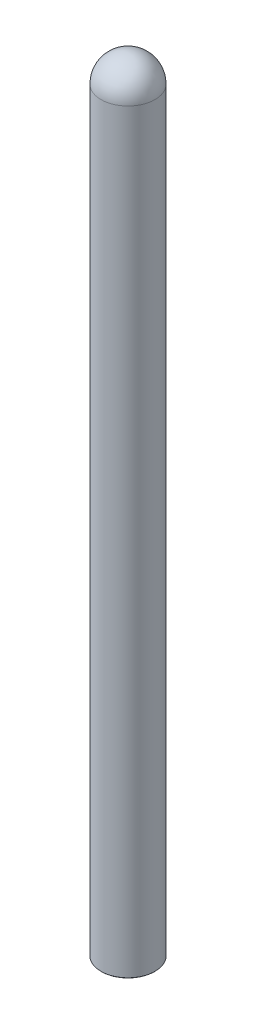
ISO-10303-21;
HEADER;
FILE_DESCRIPTION(('STEP AP214'),'2;1');
FILE_NAME('part.step','',(''),(''),'','','');
FILE_SCHEMA(('AUTOMOTIVE_DESIGN { 1 0 10303 214 1 1 1 1 }'));
ENDSEC;
DATA;
#1=APPLICATION_CONTEXT('core data for automotive mechanical design processes');
#2=APPLICATION_PROTOCOL_DEFINITION('international standard','automotive_design',2000,#1);
#3=PRODUCT_CONTEXT('',#1,'mechanical');
#4=PRODUCT('Part','Part','',(#3));
#5=PRODUCT_RELATED_PRODUCT_CATEGORY('part','',(#4));
#6=PRODUCT_DEFINITION_FORMATION('','',#4);
#7=PRODUCT_DEFINITION_CONTEXT('part definition',#1,'design');
#8=PRODUCT_DEFINITION('design','',#6,#7);
#9=PRODUCT_DEFINITION_SHAPE('','',#8);
#10=(LENGTH_UNIT() NAMED_UNIT(*) SI_UNIT(.MILLI.,.METRE.));
#11=(NAMED_UNIT(*) PLANE_ANGLE_UNIT() SI_UNIT($,.RADIAN.));
#12=(NAMED_UNIT(*) SI_UNIT($,.STERADIAN.) SOLID_ANGLE_UNIT());
#13=UNCERTAINTY_MEASURE_WITH_UNIT(LENGTH_MEASURE(1.E-05),#10,'distance_accuracy_value','');
#14=(GEOMETRIC_REPRESENTATION_CONTEXT(3) GLOBAL_UNCERTAINTY_ASSIGNED_CONTEXT((#13)) GLOBAL_UNIT_ASSIGNED_CONTEXT((#10,
#11,#12)) REPRESENTATION_CONTEXT('',''));
#15=CARTESIAN_POINT('',(0.,0.,0.));
#16=DIRECTION('',(0.,0.,1.));
#17=DIRECTION('',(1.,0.,0.));
#18=AXIS2_PLACEMENT_3D('',#15,#16,#17);
#19=CARTESIAN_POINT('',(0.,0.,0.));
#20=DIRECTION('',(0.,-1.,0.));
#21=DIRECTION('',(0.,0.,-1.));
#22=AXIS2_PLACEMENT_3D('',#19,#20,#21);
#23=PLANE('',#22);
#24=CARTESIAN_POINT('',(0.,0.,0.));
#25=DIRECTION('',(0.,-1.,0.));
#26=DIRECTION('',(0.,0.,-1.));
#27=AXIS2_PLACEMENT_3D('',#24,#25,#26);
#28=CIRCLE('',#27,0.520000000000003);
#29=CARTESIAN_POINT('',(0.,0.,-0.520000000000003));
#30=VERTEX_POINT('',#29);
#31=EDGE_CURVE('E40',#30,#30,#28,.F.);
#32=ORIENTED_EDGE('',*,*,#31,.T.);
#33=EDGE_LOOP('',(#32));
#34=FACE_BOUND('',#33,.T.);
#35=CARTESIAN_POINT('',(0.,0.,0.));
#36=DIRECTION('',(0.,-1.,0.));
#37=DIRECTION('',(0.,0.,-1.));
#38=AXIS2_PLACEMENT_3D('',#35,#36,#37);
#39=CIRCLE('',#38,0.979999999999998);
#40=CARTESIAN_POINT('',(0.,0.,0.979999999999998));
#41=VERTEX_POINT('',#40);
#42=EDGE_CURVE('E44',#41,#41,#39,.T.);
#43=ORIENTED_EDGE('',*,*,#42,.T.);
#44=EDGE_LOOP('',(#43));
#45=FACE_BOUND('',#44,.T.);
#46=ADVANCED_FACE('F33',(#34,#45),#23,.T.);
#47=CARTESIAN_POINT('',(0.,28.,0.));
#48=DIRECTION('',(0.,1.,0.));
#49=DIRECTION('',(1.,0.,0.));
#50=AXIS2_PLACEMENT_3D('',#47,#48,#49);
#51=SPHERICAL_SURFACE('',#50,1.);
#52=CARTESIAN_POINT('',(0.,28.,0.));
#53=DIRECTION('',(0.,1.,0.));
#54=DIRECTION('',(0.,0.,1.));
#55=AXIS2_PLACEMENT_3D('',#52,#53,#54);
#56=CIRCLE('',#55,1.);
#57=CARTESIAN_POINT('',(0.,28.,1.));
#58=VERTEX_POINT('',#57);
#59=EDGE_CURVE('E53',#58,#58,#56,.T.);
#60=ORIENTED_EDGE('',*,*,#59,.T.);
#61=EDGE_LOOP('',(#60));
#62=FACE_BOUND('',#61,.T.);
#63=ADVANCED_FACE('F72',(#62),#51,.T.);
#64=CARTESIAN_POINT('',(0.,0.,0.));
#65=DIRECTION('',(0.,1.,0.));
#66=DIRECTION('',(0.,0.,1.));
#67=AXIS2_PLACEMENT_3D('',#64,#65,#66);
#68=CYLINDRICAL_SURFACE('',#67,1.);
#69=CARTESIAN_POINT('',(0.,0.0200000000000019,0.));
#70=DIRECTION('',(0.,-1.,0.));
#71=DIRECTION('',(0.,0.,-1.));
#72=AXIS2_PLACEMENT_3D('',#69,#70,#71);
#73=CIRCLE('',#72,1.);
#74=CARTESIAN_POINT('',(0.,0.0200000000000019,1.));
#75=VERTEX_POINT('',#74);
#76=EDGE_CURVE('E48',#75,#75,#73,.F.);
#77=ORIENTED_EDGE('',*,*,#76,.T.);
#78=EDGE_LOOP('',(#77));
#79=FACE_BOUND('',#78,.T.);
#80=ORIENTED_EDGE('',*,*,#59,.F.);
#81=EDGE_LOOP('',(#80));
#82=FACE_BOUND('',#81,.T.);
#83=ADVANCED_FACE('F65',(#79,#82),#68,.T.);
#84=CARTESIAN_POINT('',(0.,0.,0.));
#85=DIRECTION('',(0.,1.,0.));
#86=DIRECTION('',(0.,0.,1.));
#87=AXIS2_PLACEMENT_3D('',#84,#85,#86);
#88=CYLINDRICAL_SURFACE('',#87,0.5);
#89=CARTESIAN_POINT('',(0.,0.019999999999999,0.));
#90=DIRECTION('',(0.,-1.,0.));
#91=DIRECTION('',(0.,0.,-1.));
#92=AXIS2_PLACEMENT_3D('',#89,#90,#91);
#93=CIRCLE('',#92,0.5);
#94=CARTESIAN_POINT('',(0.,0.019999999999999,-0.5));
#95=VERTEX_POINT('',#94);
#96=EDGE_CURVE('E10',#95,#95,#93,.T.);
#97=ORIENTED_EDGE('',*,*,#96,.T.);
#98=EDGE_LOOP('',(#97));
#99=FACE_BOUND('',#98,.T.);
#100=CARTESIAN_POINT('',(0.,28.,0.));
#101=DIRECTION('',(0.,1.,0.));
#102=DIRECTION('',(0.,0.,1.));
#103=AXIS2_PLACEMENT_3D('',#100,#101,#102);
#104=CIRCLE('',#103,0.5);
#105=CARTESIAN_POINT('',(0.,28.,0.5));
#106=VERTEX_POINT('',#105);
#107=EDGE_CURVE('E56',#106,#106,#104,.F.);
#108=ORIENTED_EDGE('',*,*,#107,.F.);
#109=EDGE_LOOP('',(#108));
#110=FACE_BOUND('',#109,.T.);
#111=ADVANCED_FACE('F62',(#99,#110),#88,.F.);
#112=CARTESIAN_POINT('',(0.,0.0200000000000019,0.));
#113=DIRECTION('',(0.,1.,0.));
#114=DIRECTION('',(0.,0.,1.));
#115=AXIS2_PLACEMENT_3D('',#112,#113,#114);
#116=CONICAL_SURFACE('',#115,1.,0.785398163397448);
#117=CARTESIAN_POINT('',(0.,0.,0.979999999999998));
#118=CARTESIAN_POINT('',(0.,0.000208333333333288,0.980208333333331));
#119=CARTESIAN_POINT('',(0.,0.000416666666666622,0.980416666666665));
#120=CARTESIAN_POINT('',(0.,0.000833333333333289,0.980833333333332));
#121=CARTESIAN_POINT('',(0.,0.00104166666666662,0.981041666666665));
#122=CARTESIAN_POINT('',(0.,0.00145833333333334,0.981458333333332));
#123=CARTESIAN_POINT('',(0.,0.00166666666666673,0.981666666666665));
#124=CARTESIAN_POINT('',(0.,0.00208333333333344,0.982083333333332));
#125=CARTESIAN_POINT('',(0.,0.00229166666666676,0.982291666666665));
#126=CARTESIAN_POINT('',(0.,0.00270833333333345,0.982708333333332));
#127=CARTESIAN_POINT('',(0.,0.00291666666666682,0.982916666666665));
#128=CARTESIAN_POINT('',(0.,0.00333333333333356,0.983333333333332));
#129=CARTESIAN_POINT('',(0.,0.00354166666666692,0.983541666666665));
#130=CARTESIAN_POINT('',(0.,0.00395833333333361,0.983958333333332));
#131=CARTESIAN_POINT('',(0.,0.00416666666666694,0.984166666666665));
#132=CARTESIAN_POINT('',(0.,0.00458333333333365,0.984583333333332));
#133=CARTESIAN_POINT('',(0.,0.00479166666666704,0.984791666666665));
#134=CARTESIAN_POINT('',(0.,0.00520833333333375,0.985208333333332));
#135=CARTESIAN_POINT('',(0.,0.00541666666666707,0.985416666666665));
#136=CARTESIAN_POINT('',(0.,0.00583333333333377,0.985833333333332));
#137=CARTESIAN_POINT('',(0.,0.00604166666666713,0.986041666666665));
#138=CARTESIAN_POINT('',(0.,0.00645833333333387,0.986458333333332));
#139=CARTESIAN_POINT('',(0.,0.00666666666666724,0.986666666666665));
#140=CARTESIAN_POINT('',(0.,0.00708333333333393,0.987083333333332));
#141=CARTESIAN_POINT('',(0.,0.00729166666666725,0.987291666666666));
#142=CARTESIAN_POINT('',(0.,0.00770833333333397,0.987708333333332));
#143=CARTESIAN_POINT('',(0.,0.00791666666666735,0.987916666666666));
#144=CARTESIAN_POINT('',(0.,0.00833333333333406,0.988333333333332));
#145=CARTESIAN_POINT('',(0.,0.00854166666666739,0.988541666666666));
#146=CARTESIAN_POINT('',(0.,0.00895833333333408,0.988958333333333));
#147=CARTESIAN_POINT('',(0.,0.00916666666666745,0.989166666666666));
#148=CARTESIAN_POINT('',(0.,0.00958333333333418,0.989583333333333));
#149=CARTESIAN_POINT('',(0.,0.00979166666666755,0.989791666666666));
#150=CARTESIAN_POINT('',(0.,0.0102083333333342,0.990208333333332));
#151=CARTESIAN_POINT('',(0.,0.0104166666666676,0.990416666666666));
#152=CARTESIAN_POINT('',(0.,0.0108333333333343,0.990833333333333));
#153=CARTESIAN_POINT('',(0.,0.0110416666666677,0.991041666666666));
#154=CARTESIAN_POINT('',(0.,0.0114583333333344,0.991458333333333));
#155=CARTESIAN_POINT('',(0.,0.0116666666666677,0.991666666666666));
#156=CARTESIAN_POINT('',(0.,0.0120833333333344,0.992083333333333));
#157=CARTESIAN_POINT('',(0.,0.0122916666666678,0.992291666666666));
#158=CARTESIAN_POINT('',(0.,0.0127083333333345,0.992708333333333));
#159=CARTESIAN_POINT('',(0.,0.0129166666666678,0.992916666666666));
#160=CARTESIAN_POINT('',(0.,0.0133333333333345,0.993333333333333));
#161=CARTESIAN_POINT('',(0.,0.0135416666666679,0.993541666666666));
#162=CARTESIAN_POINT('',(0.,0.0139583333333346,0.993958333333333));
#163=CARTESIAN_POINT('',(0.,0.014166666666668,0.994166666666666));
#164=CARTESIAN_POINT('',(0.,0.0145833333333347,0.994583333333333));
#165=CARTESIAN_POINT('',(0.,0.014791666666668,0.994791666666666));
#166=CARTESIAN_POINT('',(0.,0.0152083333333347,0.995208333333333));
#167=CARTESIAN_POINT('',(0.,0.0154166666666681,0.995416666666666));
#168=CARTESIAN_POINT('',(0.,0.0158333333333348,0.995833333333333));
#169=CARTESIAN_POINT('',(0.,0.0160416666666681,0.996041666666667));
#170=CARTESIAN_POINT('',(0.,0.0164583333333348,0.996458333333333));
#171=CARTESIAN_POINT('',(0.,0.0166666666666682,0.996666666666667));
#172=CARTESIAN_POINT('',(0.,0.0170833333333349,0.997083333333333));
#173=CARTESIAN_POINT('',(0.,0.0172916666666683,0.997291666666666));
#174=CARTESIAN_POINT('',(0.,0.017708333333335,0.997708333333333));
#175=CARTESIAN_POINT('',(0.,0.0179166666666683,0.997916666666667));
#176=CARTESIAN_POINT('',(0.,0.018333333333335,0.998333333333334));
#177=CARTESIAN_POINT('',(0.,0.0185416666666684,0.998541666666667));
#178=CARTESIAN_POINT('',(0.,0.0189583333333351,0.998958333333334));
#179=CARTESIAN_POINT('',(0.,0.0191666666666685,0.999166666666667));
#180=CARTESIAN_POINT('',(0.,0.0195833333333351,0.999583333333334));
#181=CARTESIAN_POINT('',(0.,0.0197916666666685,0.999791666666667));
#182=CARTESIAN_POINT('',(0.,0.0200000000000019,1.));
#183=B_SPLINE_CURVE_WITH_KNOTS('',3,(#117,#118,#119,#120,#121,#122,#123,#124,#125,#126,#127,
#128,#129,#130,#131,#132,#133,#134,#135,#136,#137,#138,#139,#140,#141,#142,#143,#144,#145,#146,
#147,#148,#149,#150,#151,#152,#153,#154,#155,#156,#157,#158,#159,#160,#161,#162,#163,#164,#165,
#166,#167,#168,#169,#170,#171,#172,#173,#174,#175,#176,#177,#178,#179,#180,#181,#182),
.UNSPECIFIED.,.F.,.F.,(4,2,2,2,2,2,2,2,2,2,2,2,2,2,2,2,2,2,2,2,2,2,2,2,2,2,2,2,2,2,2,2,4),(0.,
0.000883883476483211,0.00176776695296657,0.00265165042944978,0.00353553390593315,
0.00441941738241636,0.00530330085889957,0.00618718433538294,0.00707106781186615,
0.00795495128834951,0.00883883476483272,0.00972271824131593,0.0106066017177993,
0.0114904851942825,0.0123743686707659,0.0132582521472491,0.0141421356237323,0.0150260191002157,
0.0159099025766989,0.0167937860531822,0.0176776695296654,0.0185615530061488,0.019445436482632,
0.0203293199591152,0.0212132034355986,0.0220970869120818,0.0229809703885652,0.0238648538650484,
0.0247487373415316,0.0256326208180149,0.0265165042944982,0.0274003877709815,0.0282842712474647),.UNSPECIFIED.);
#184=EDGE_CURVE('BSEAM64',#41,#75,#183,.T.);
#185=ORIENTED_EDGE('',*,*,#42,.F.);
#186=ORIENTED_EDGE('',*,*,#76,.F.);
#187=ORIENTED_EDGE('',*,*,#184,.T.);
#188=ORIENTED_EDGE('',*,*,#184,.F.);
#189=EDGE_LOOP('',(#185,#187,#186,#188));
#190=FACE_BOUND('',#189,.T.);
#191=ADVANCED_FACE('F64',(#190),#116,.T.);
#192=CARTESIAN_POINT('',(0.,0.,0.));
#193=DIRECTION('',(0.,-1.,0.));
#194=DIRECTION('',(0.,0.,-1.));
#195=AXIS2_PLACEMENT_3D('',#192,#193,#194);
#196=CONICAL_SURFACE('',#195,0.520000000000003,0.785398163397543);
#197=ORIENTED_EDGE('',*,*,#96,.F.);
#198=EDGE_LOOP('',(#197));
#199=FACE_BOUND('',#198,.T.);
#200=ORIENTED_EDGE('',*,*,#31,.F.);
#201=EDGE_LOOP('',(#200));
#202=FACE_BOUND('',#201,.T.);
#203=ADVANCED_FACE('F35',(#199,#202),#196,.F.);
#204=CARTESIAN_POINT('',(-1.,28.,0.));
#205=DIRECTION('',(0.,1.,0.));
#206=DIRECTION('',(0.,0.,1.));
#207=AXIS2_PLACEMENT_3D('',#204,#205,#206);
#208=PLANE('',#207);
#209=ORIENTED_EDGE('',*,*,#107,.T.);
#210=EDGE_LOOP('',(#209));
#211=FACE_BOUND('',#210,.T.);
#212=ADVANCED_FACE('F60',(#211),#208,.F.);
#213=CLOSED_SHELL('',(#46,#63,#83,#111,#191,#203,#212));
#214=MANIFOLD_SOLID_BREP('B2',#213);
#215=ADVANCED_BREP_SHAPE_REPRESENTATION('',(#18,#214),#14);
#216=SHAPE_DEFINITION_REPRESENTATION(#9,#215);
ENDSEC;
END-ISO-10303-21;
